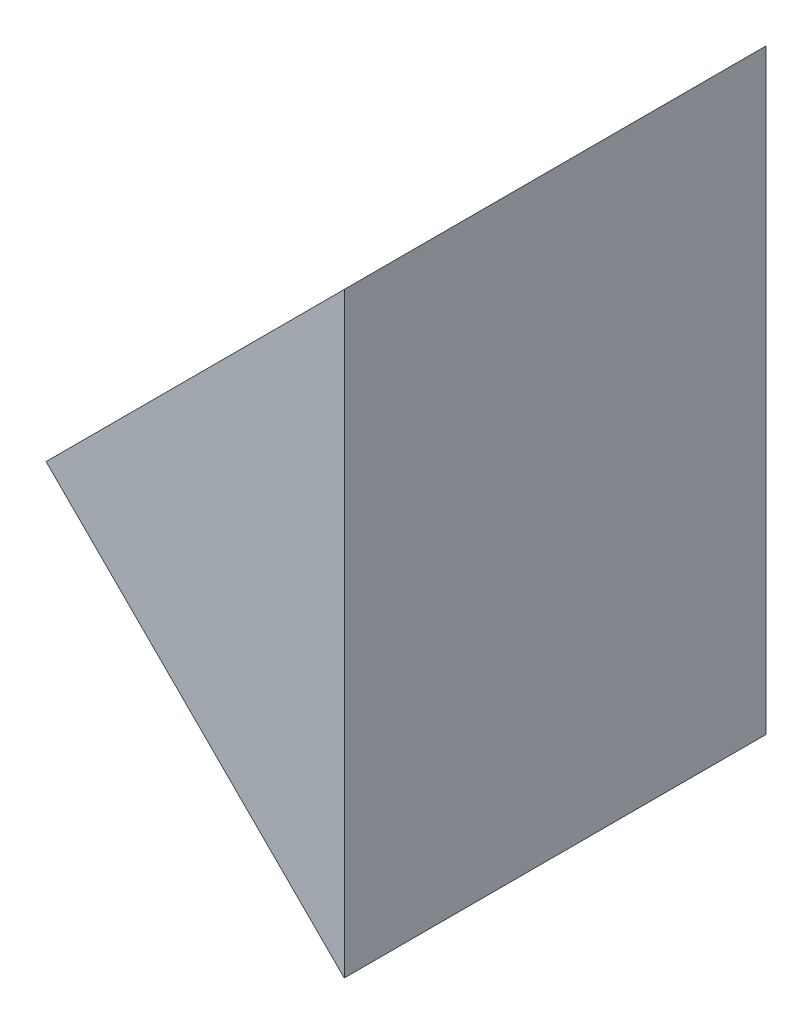
ISO-10303-21;
HEADER;
FILE_DESCRIPTION(('STEP AP214'),'2;1');
FILE_NAME('part.step','',(''),(''),'','','');
FILE_SCHEMA(('AUTOMOTIVE_DESIGN { 1 0 10303 214 1 1 1 1 }'));
ENDSEC;
DATA;
#1=APPLICATION_CONTEXT('core data for automotive mechanical design processes');
#2=APPLICATION_PROTOCOL_DEFINITION('international standard','automotive_design',2000,#1);
#3=PRODUCT_CONTEXT('',#1,'mechanical');
#4=PRODUCT('Part','Part','',(#3));
#5=PRODUCT_RELATED_PRODUCT_CATEGORY('part','',(#4));
#6=PRODUCT_DEFINITION_FORMATION('','',#4);
#7=PRODUCT_DEFINITION_CONTEXT('part definition',#1,'design');
#8=PRODUCT_DEFINITION('design','',#6,#7);
#9=PRODUCT_DEFINITION_SHAPE('','',#8);
#10=(LENGTH_UNIT() NAMED_UNIT(*) SI_UNIT(.MILLI.,.METRE.));
#11=(NAMED_UNIT(*) PLANE_ANGLE_UNIT() SI_UNIT($,.RADIAN.));
#12=(NAMED_UNIT(*) SI_UNIT($,.STERADIAN.) SOLID_ANGLE_UNIT());
#13=UNCERTAINTY_MEASURE_WITH_UNIT(LENGTH_MEASURE(1.E-05),#10,'distance_accuracy_value','');
#14=(GEOMETRIC_REPRESENTATION_CONTEXT(3) GLOBAL_UNCERTAINTY_ASSIGNED_CONTEXT((#13)) GLOBAL_UNIT_ASSIGNED_CONTEXT((#10,
#11,#12)) REPRESENTATION_CONTEXT('',''));
#15=CARTESIAN_POINT('',(0.,0.,0.));
#16=DIRECTION('',(0.,0.,1.));
#17=DIRECTION('',(1.,0.,0.));
#18=AXIS2_PLACEMENT_3D('',#15,#16,#17);
#19=CARTESIAN_POINT('',(295.061019292638,47.6652590738952,30.));
#20=DIRECTION('',(-1.,0.,0.));
#21=DIRECTION('',(0.,0.,1.));
#22=AXIS2_PLACEMENT_3D('',#19,#20,#21);
#23=PLANE('',#22);
#24=DIRECTION('',(0.,1.,0.));
#25=VECTOR('',#24,1.);
#26=CARTESIAN_POINT('',(295.061019292638,47.6652590738952,0.));
#27=LINE('',#26,#25);
#28=CARTESIAN_POINT('',(295.061019292638,47.6652590738952,0.));
#29=VERTEX_POINT('',#28);
#30=CARTESIAN_POINT('',(295.061019292638,90.0916659450881,0.));
#31=VERTEX_POINT('',#30);
#32=EDGE_CURVE('E84',#29,#31,#27,.T.);
#33=ORIENTED_EDGE('',*,*,#32,.T.);
#34=DIRECTION('',(0.,0.,-1.));
#35=VECTOR('',#34,1.);
#36=CARTESIAN_POINT('',(295.061019292638,90.0916659450881,30.));
#37=LINE('',#36,#35);
#38=CARTESIAN_POINT('',(295.061019292638,90.0916659450881,30.));
#39=VERTEX_POINT('',#38);
#40=EDGE_CURVE('E11',#39,#31,#37,.T.);
#41=ORIENTED_EDGE('',*,*,#40,.F.);
#42=DIRECTION('',(0.,1.,0.));
#43=VECTOR('',#42,1.);
#44=CARTESIAN_POINT('',(295.061019292638,47.6652590738952,30.));
#45=LINE('',#44,#43);
#46=CARTESIAN_POINT('',(295.061019292638,47.6652590738952,30.));
#47=VERTEX_POINT('',#46);
#48=EDGE_CURVE('E77',#47,#39,#45,.T.);
#49=ORIENTED_EDGE('',*,*,#48,.F.);
#50=DIRECTION('',(0.,0.,-1.));
#51=VECTOR('',#50,1.);
#52=CARTESIAN_POINT('',(295.061019292638,47.6652590738952,30.));
#53=LINE('',#52,#51);
#54=EDGE_CURVE('E85',#47,#29,#53,.T.);
#55=ORIENTED_EDGE('',*,*,#54,.T.);
#56=EDGE_LOOP('',(#33,#41,#49,#55));
#57=FACE_BOUND('',#56,.T.);
#58=ADVANCED_FACE('F37',(#57),#23,.F.);
#59=CARTESIAN_POINT('',(295.061019292638,90.0916659450881,30.));
#60=DIRECTION('',(0.707106781186547,-0.707106781186549,0.));
#61=DIRECTION('',(0.707106781186549,0.707106781186547,0.));
#62=AXIS2_PLACEMENT_3D('',#59,#60,#61);
#63=PLANE('',#62);
#64=DIRECTION('',(-0.707106781186548,-0.707106781186547,0.));
#65=VECTOR('',#64,1.);
#66=CARTESIAN_POINT('',(295.061019292638,90.0916659450881,0.));
#67=LINE('',#66,#65);
#68=CARTESIAN_POINT('',(273.847815857042,68.8784625094916,0.));
#69=VERTEX_POINT('',#68);
#70=EDGE_CURVE('E65',#31,#69,#67,.T.);
#71=ORIENTED_EDGE('',*,*,#70,.T.);
#72=DIRECTION('',(0.,0.,-1.));
#73=VECTOR('',#72,1.);
#74=CARTESIAN_POINT('',(273.847815857042,68.8784625094916,30.));
#75=LINE('',#74,#73);
#76=CARTESIAN_POINT('',(273.847815857042,68.8784625094916,30.));
#77=VERTEX_POINT('',#76);
#78=EDGE_CURVE('E45',#77,#69,#75,.T.);
#79=ORIENTED_EDGE('',*,*,#78,.F.);
#80=DIRECTION('',(-0.707106781186548,-0.707106781186547,0.));
#81=VECTOR('',#80,1.);
#82=CARTESIAN_POINT('',(295.061019292638,90.0916659450881,30.));
#83=LINE('',#82,#81);
#84=EDGE_CURVE('E73',#39,#77,#83,.T.);
#85=ORIENTED_EDGE('',*,*,#84,.F.);
#86=ORIENTED_EDGE('',*,*,#40,.T.);
#87=EDGE_LOOP('',(#71,#79,#85,#86));
#88=FACE_BOUND('',#87,.T.);
#89=ADVANCED_FACE('F74',(#88),#63,.F.);
#90=CARTESIAN_POINT('',(273.847815857042,68.8784625094916,30.));
#91=DIRECTION('',(0.707106781186547,0.707106781186548,0.));
#92=DIRECTION('',(-0.707106781186548,0.707106781186547,0.));
#93=AXIS2_PLACEMENT_3D('',#90,#91,#92);
#94=PLANE('',#93);
#95=DIRECTION('',(0.707106781186548,-0.707106781186547,0.));
#96=VECTOR('',#95,1.);
#97=CARTESIAN_POINT('',(273.847815857042,68.8784625094916,0.));
#98=LINE('',#97,#96);
#99=EDGE_CURVE('E70',#69,#29,#98,.T.);
#100=ORIENTED_EDGE('',*,*,#99,.T.);
#101=ORIENTED_EDGE('',*,*,#54,.F.);
#102=DIRECTION('',(0.707106781186548,-0.707106781186547,0.));
#103=VECTOR('',#102,1.);
#104=CARTESIAN_POINT('',(273.847815857042,68.8784625094916,30.));
#105=LINE('',#104,#103);
#106=EDGE_CURVE('E53',#77,#47,#105,.T.);
#107=ORIENTED_EDGE('',*,*,#106,.F.);
#108=ORIENTED_EDGE('',*,*,#78,.T.);
#109=EDGE_LOOP('',(#100,#101,#107,#108));
#110=FACE_BOUND('',#109,.T.);
#111=ADVANCED_FACE('F92',(#110),#94,.F.);
#112=CARTESIAN_POINT('',(0.,0.,30.));
#113=DIRECTION('',(0.,0.,1.));
#114=DIRECTION('',(1.,0.,0.));
#115=AXIS2_PLACEMENT_3D('',#112,#113,#114);
#116=PLANE('',#115);
#117=ORIENTED_EDGE('',*,*,#48,.T.);
#118=ORIENTED_EDGE('',*,*,#84,.T.);
#119=ORIENTED_EDGE('',*,*,#106,.T.);
#120=EDGE_LOOP('',(#117,#118,#119));
#121=FACE_BOUND('',#120,.T.);
#122=ADVANCED_FACE('F80',(#121),#116,.T.);
#123=CARTESIAN_POINT('',(0.,0.,0.));
#124=DIRECTION('',(0.,0.,1.));
#125=DIRECTION('',(1.,0.,0.));
#126=AXIS2_PLACEMENT_3D('',#123,#124,#125);
#127=PLANE('',#126);
#128=ORIENTED_EDGE('',*,*,#32,.F.);
#129=ORIENTED_EDGE('',*,*,#99,.F.);
#130=ORIENTED_EDGE('',*,*,#70,.F.);
#131=EDGE_LOOP('',(#128,#129,#130));
#132=FACE_BOUND('',#131,.T.);
#133=ADVANCED_FACE('F93',(#132),#127,.F.);
#134=CLOSED_SHELL('',(#58,#89,#111,#122,#133));
#135=MANIFOLD_SOLID_BREP('B2',#134);
#136=ADVANCED_BREP_SHAPE_REPRESENTATION('',(#18,#135),#14);
#137=SHAPE_DEFINITION_REPRESENTATION(#9,#136);
ENDSEC;
END-ISO-10303-21;
